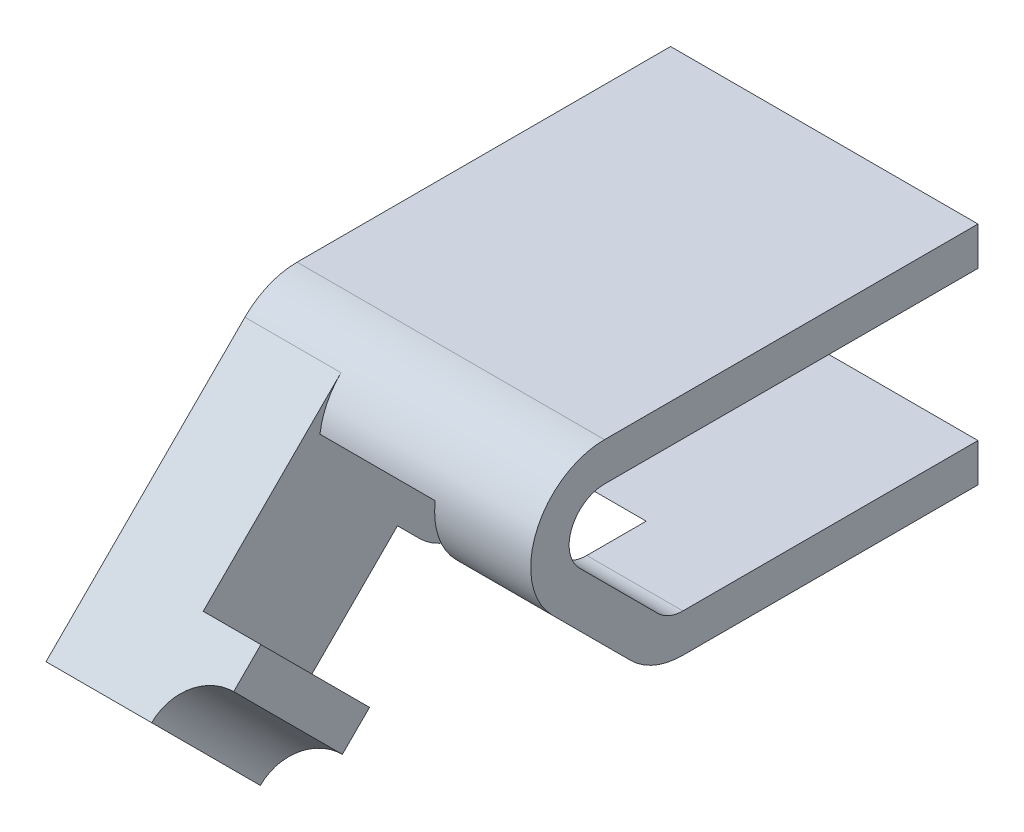
ISO-10303-21;
HEADER;
FILE_DESCRIPTION(('STEP AP214'),'2;1');
FILE_NAME('part.step','',(''),(''),'','','');
FILE_SCHEMA(('AUTOMOTIVE_DESIGN { 1 0 10303 214 1 1 1 1 }'));
ENDSEC;
DATA;
#1=APPLICATION_CONTEXT('core data for automotive mechanical design processes');
#2=APPLICATION_PROTOCOL_DEFINITION('international standard','automotive_design',2000,#1);
#3=PRODUCT_CONTEXT('',#1,'mechanical');
#4=PRODUCT('Part','Part','',(#3));
#5=PRODUCT_RELATED_PRODUCT_CATEGORY('part','',(#4));
#6=PRODUCT_DEFINITION_FORMATION('','',#4);
#7=PRODUCT_DEFINITION_CONTEXT('part definition',#1,'design');
#8=PRODUCT_DEFINITION('design','',#6,#7);
#9=PRODUCT_DEFINITION_SHAPE('','',#8);
#10=(LENGTH_UNIT() NAMED_UNIT(*) SI_UNIT(.MILLI.,.METRE.));
#11=(NAMED_UNIT(*) PLANE_ANGLE_UNIT() SI_UNIT($,.RADIAN.));
#12=(NAMED_UNIT(*) SI_UNIT($,.STERADIAN.) SOLID_ANGLE_UNIT());
#13=UNCERTAINTY_MEASURE_WITH_UNIT(LENGTH_MEASURE(1.E-05),#10,'distance_accuracy_value','');
#14=(GEOMETRIC_REPRESENTATION_CONTEXT(3) GLOBAL_UNCERTAINTY_ASSIGNED_CONTEXT((#13)) GLOBAL_UNIT_ASSIGNED_CONTEXT((#10,
#11,#12)) REPRESENTATION_CONTEXT('',''));
#15=CARTESIAN_POINT('',(0.,0.,0.));
#16=DIRECTION('',(0.,0.,1.));
#17=DIRECTION('',(1.,0.,0.));
#18=AXIS2_PLACEMENT_3D('',#15,#16,#17);
#19=CARTESIAN_POINT('',(25.4,-5.588,0.));
#20=DIRECTION('',(-1.,0.,0.));
#21=DIRECTION('',(0.,0.,1.));
#22=AXIS2_PLACEMENT_3D('',#19,#20,#21);
#23=CYLINDRICAL_SURFACE('',#22,12.192);
#24=DIRECTION('',(-1.,0.,0.));
#25=VECTOR('',#24,1.);
#26=CARTESIAN_POINT('',(9.75224461638645,3.0330458762264,8.62104587622637));
#27=LINE('',#26,#25);
#28=CARTESIAN_POINT('',(-9.525,3.0330458762264,8.62104587622637));
#29=VERTEX_POINT('',#28);
#30=CARTESIAN_POINT('',(-25.4,3.0330458762264,8.62104587622637));
#31=VERTEX_POINT('',#30);
#32=EDGE_CURVE('E241',#29,#31,#27,.T.);
#33=ORIENTED_EDGE('',*,*,#32,.F.);
#34=CARTESIAN_POINT('',(-9.525,-5.588,0.));
#35=DIRECTION('',(-1.,0.,0.));
#36=DIRECTION('',(0.,0.,1.));
#37=AXIS2_PLACEMENT_3D('',#34,#35,#36);
#38=CIRCLE('',#37,12.192);
#39=CARTESIAN_POINT('',(-9.525,-4.03006145173267,12.0920507557578));
#40=VERTEX_POINT('',#39);
#41=EDGE_CURVE('E249',#40,#29,#38,.T.);
#42=ORIENTED_EDGE('',*,*,#41,.F.);
#43=DIRECTION('',(-1.,0.,0.));
#44=VECTOR('',#43,1.);
#45=CARTESIAN_POINT('',(25.4,-4.03006145173266,12.0920507557578));
#46=LINE('',#45,#44);
#47=CARTESIAN_POINT('',(9.525,-4.03006145173267,12.0920507557578));
#48=VERTEX_POINT('',#47);
#49=EDGE_CURVE('E44',#40,#48,#46,.F.);
#50=ORIENTED_EDGE('',*,*,#49,.T.);
#51=CARTESIAN_POINT('',(9.525,-5.588,0.));
#52=DIRECTION('',(-1.,0.,0.));
#53=DIRECTION('',(0.,0.,1.));
#54=AXIS2_PLACEMENT_3D('',#51,#52,#53);
#55=CIRCLE('',#54,12.192);
#56=CARTESIAN_POINT('',(9.525,-14.2090458762264,8.62104587622641));
#57=VERTEX_POINT('',#56);
#58=EDGE_CURVE('E309',#57,#48,#55,.T.);
#59=ORIENTED_EDGE('',*,*,#58,.F.);
#60=DIRECTION('',(-1.,0.,0.));
#61=VECTOR('',#60,1.);
#62=CARTESIAN_POINT('',(25.4,-14.2090458762264,8.6210458762264));
#63=LINE('',#62,#61);
#64=CARTESIAN_POINT('',(25.4,-14.2090458762264,8.6210458762264));
#65=VERTEX_POINT('',#64);
#66=EDGE_CURVE('E275',#65,#57,#63,.T.);
#67=ORIENTED_EDGE('',*,*,#66,.F.);
#68=CARTESIAN_POINT('',(25.4,-5.588,0.));
#69=DIRECTION('',(1.,0.,0.));
#70=DIRECTION('',(0.,0.,-1.));
#71=AXIS2_PLACEMENT_3D('',#68,#69,#70);
#72=CIRCLE('',#71,12.192);
#73=CARTESIAN_POINT('',(25.4,6.604,0.));
#74=VERTEX_POINT('',#73);
#75=EDGE_CURVE('E381',#74,#65,#72,.T.);
#76=ORIENTED_EDGE('',*,*,#75,.F.);
#77=DIRECTION('',(-1.,0.,0.));
#78=VECTOR('',#77,1.);
#79=CARTESIAN_POINT('',(25.4,6.604,0.));
#80=LINE('',#79,#78);
#81=CARTESIAN_POINT('',(-25.4,6.604,0.));
#82=VERTEX_POINT('',#81);
#83=EDGE_CURVE('E254',#74,#82,#80,.T.);
#84=ORIENTED_EDGE('',*,*,#83,.T.);
#85=CARTESIAN_POINT('',(-25.4,-5.588,0.));
#86=DIRECTION('',(1.,0.,0.));
#87=DIRECTION('',(0.,0.,-1.));
#88=AXIS2_PLACEMENT_3D('',#85,#86,#87);
#89=CIRCLE('',#88,12.192);
#90=EDGE_CURVE('E231',#82,#31,#89,.T.);
#91=ORIENTED_EDGE('',*,*,#90,.T.);
#92=EDGE_LOOP('',(#33,#42,#50,#59,#67,#76,#84,#91));
#93=FACE_BOUND('',#92,.T.);
#94=ADVANCED_FACE('F36',(#93),#23,.T.);
#95=CARTESIAN_POINT('',(25.4,-14.2090458762264,8.6210458762264));
#96=DIRECTION('',(0.,0.707106781186546,-0.707106781186549));
#97=DIRECTION('',(0.,0.707106781186549,0.707106781186546));
#98=AXIS2_PLACEMENT_3D('',#95,#96,#97);
#99=PLANE('',#98);
#100=DIRECTION('',(-1.,0.,0.));
#101=VECTOR('',#100,1.);
#102=CARTESIAN_POINT('',(-25.4,-23.5485122421383,-0.718420489685498));
#103=LINE('',#102,#101);
#104=CARTESIAN_POINT('',(-9.525,-23.5485122421383,-0.718420489685511));
#105=VERTEX_POINT('',#104);
#106=CARTESIAN_POINT('',(-25.4,-23.5485122421383,-0.718420489685498));
#107=VERTEX_POINT('',#106);
#108=EDGE_CURVE('E459',#105,#107,#103,.T.);
#109=ORIENTED_EDGE('',*,*,#108,.T.);
#110=DIRECTION('',(0.,-0.707106781186549,-0.707106781186546));
#111=VECTOR('',#110,1.);
#112=CARTESIAN_POINT('',(-25.4,-14.2090458762264,8.6210458762264));
#113=LINE('',#112,#111);
#114=CARTESIAN_POINT('',(-25.4,-27.1630458762264,-4.33295412377356));
#115=VERTEX_POINT('',#114);
#116=EDGE_CURVE('E255',#107,#115,#113,.T.);
#117=ORIENTED_EDGE('',*,*,#116,.T.);
#118=DIRECTION('',(-1.,0.,0.));
#119=VECTOR('',#118,1.);
#120=CARTESIAN_POINT('',(25.4,-27.1630458762264,-4.33295412377356));
#121=LINE('',#120,#119);
#122=CARTESIAN_POINT('',(-9.525,-27.1630458762264,-4.33295412377358));
#123=VERTEX_POINT('',#122);
#124=EDGE_CURVE('E270',#123,#115,#121,.T.);
#125=ORIENTED_EDGE('',*,*,#124,.F.);
#126=DIRECTION('',(0.,-0.707106781186547,-0.707106781186548));
#127=VECTOR('',#126,1.);
#128=CARTESIAN_POINT('',(-9.525,-30.734,-7.90390824754722));
#129=LINE('',#128,#127);
#130=EDGE_CURVE('E332',#105,#123,#129,.T.);
#131=ORIENTED_EDGE('',*,*,#130,.F.);
#132=EDGE_LOOP('',(#109,#117,#125,#131));
#133=FACE_BOUND('',#132,.T.);
#134=ADVANCED_FACE('F457',(#133),#99,.F.);
#135=CARTESIAN_POINT('',(25.4,-18.542,-12.9539999999999));
#136=DIRECTION('',(-1.,0.,0.));
#137=DIRECTION('',(0.,0.,1.));
#138=AXIS2_PLACEMENT_3D('',#135,#136,#137);
#139=CYLINDRICAL_SURFACE('',#138,5.842);
#140=DIRECTION('',(-1.,0.,0.));
#141=VECTOR('',#140,1.);
#142=CARTESIAN_POINT('',(25.4,-24.384,-12.9539999999999));
#143=LINE('',#142,#141);
#144=CARTESIAN_POINT('',(25.4,-24.384,-12.9539999999999));
#145=VERTEX_POINT('',#144);
#146=CARTESIAN_POINT('',(9.525,-24.384,-12.9539999999999));
#147=VERTEX_POINT('',#146);
#148=EDGE_CURVE('E294',#145,#147,#143,.T.);
#149=ORIENTED_EDGE('',*,*,#148,.T.);
#150=CARTESIAN_POINT('',(9.525,-18.542,-12.9539999999999));
#151=DIRECTION('',(-1.,0.,0.));
#152=DIRECTION('',(0.,0.,1.));
#153=AXIS2_PLACEMENT_3D('',#150,#151,#152);
#154=CIRCLE('',#153,5.842);
#155=CARTESIAN_POINT('',(9.525,-22.6729178156918,-8.82308218430814));
#156=VERTEX_POINT('',#155);
#157=EDGE_CURVE('E340',#147,#156,#154,.T.);
#158=ORIENTED_EDGE('',*,*,#157,.T.);
#159=DIRECTION('',(-1.,0.,0.));
#160=VECTOR('',#159,1.);
#161=CARTESIAN_POINT('',(25.4,-22.6729178156918,-8.82308218430814));
#162=LINE('',#161,#160);
#163=CARTESIAN_POINT('',(25.4,-22.6729178156918,-8.82308218430814));
#164=VERTEX_POINT('',#163);
#165=EDGE_CURVE('E290',#164,#156,#162,.T.);
#166=ORIENTED_EDGE('',*,*,#165,.F.);
#167=CARTESIAN_POINT('',(25.4,-18.542,-12.9539999999999));
#168=DIRECTION('',(1.,0.,0.));
#169=DIRECTION('',(0.,0.,-1.));
#170=AXIS2_PLACEMENT_3D('',#167,#168,#169);
#171=CIRCLE('',#170,5.842);
#172=EDGE_CURVE('E364',#164,#145,#171,.T.);
#173=ORIENTED_EDGE('',*,*,#172,.T.);
#174=EDGE_LOOP('',(#149,#158,#166,#173));
#175=FACE_BOUND('',#174,.T.);
#176=ADVANCED_FACE('F508',(#175),#139,.F.);
#177=CARTESIAN_POINT('',(25.4,-9.7189178156918,4.13091781569182));
#178=DIRECTION('',(0.,0.707106781186546,-0.707106781186549));
#179=DIRECTION('',(0.,0.707106781186549,0.707106781186546));
#180=AXIS2_PLACEMENT_3D('',#177,#178,#179);
#181=PLANE('',#180);
#182=ORIENTED_EDGE('',*,*,#165,.T.);
#183=DIRECTION('',(0.,0.707106781186549,0.707106781186546));
#184=VECTOR('',#183,1.);
#185=CARTESIAN_POINT('',(9.525,-9.7189178156918,4.13091781569182));
#186=LINE('',#185,#184);
#187=CARTESIAN_POINT('',(9.525,-9.7189178156918,4.13091781569182));
#188=VERTEX_POINT('',#187);
#189=EDGE_CURVE('E337',#156,#188,#186,.T.);
#190=ORIENTED_EDGE('',*,*,#189,.T.);
#191=DIRECTION('',(-1.,0.,0.));
#192=VECTOR('',#191,1.);
#193=CARTESIAN_POINT('',(25.4,-9.7189178156918,4.13091781569182));
#194=LINE('',#193,#192);
#195=CARTESIAN_POINT('',(25.4,-9.7189178156918,4.13091781569182));
#196=VERTEX_POINT('',#195);
#197=EDGE_CURVE('E286',#196,#188,#194,.T.);
#198=ORIENTED_EDGE('',*,*,#197,.F.);
#199=DIRECTION('',(0.,-0.707106781186549,-0.707106781186546));
#200=VECTOR('',#199,1.);
#201=CARTESIAN_POINT('',(25.4,-9.7189178156918,4.13091781569182));
#202=LINE('',#201,#200);
#203=EDGE_CURVE('E367',#196,#164,#202,.T.);
#204=ORIENTED_EDGE('',*,*,#203,.T.);
#205=EDGE_LOOP('',(#182,#190,#198,#204));
#206=FACE_BOUND('',#205,.T.);
#207=ADVANCED_FACE('F504',(#206),#181,.T.);
#208=DIRECTION('',(0.,-0.707106781186547,-0.707106781186548));
#209=VECTOR('',#208,1.);
#210=CARTESIAN_POINT('',(9.525,-30.734,-7.90390824754722));
#211=LINE('',#210,#209);
#212=CARTESIAN_POINT('',(9.525,-27.1630458762264,-4.33295412377358));
#213=VERTEX_POINT('',#212);
#214=EDGE_CURVE('E319',#57,#213,#211,.T.);
#215=ORIENTED_EDGE('',*,*,#214,.T.);
#216=CARTESIAN_POINT('',(25.4,-27.1630458762264,-4.33295412377356));
#217=VERTEX_POINT('',#216);
#218=EDGE_CURVE('E272',#217,#213,#121,.T.);
#219=ORIENTED_EDGE('',*,*,#218,.F.);
#220=DIRECTION('',(0.,-0.707106781186549,-0.707106781186546));
#221=VECTOR('',#220,1.);
#222=CARTESIAN_POINT('',(25.4,-14.2090458762264,8.6210458762264));
#223=LINE('',#222,#221);
#224=EDGE_CURVE('E383',#65,#217,#223,.T.);
#225=ORIENTED_EDGE('',*,*,#224,.F.);
#226=ORIENTED_EDGE('',*,*,#66,.T.);
#227=EDGE_LOOP('',(#215,#219,#225,#226));
#228=FACE_BOUND('',#227,.T.);
#229=ADVANCED_FACE('F554',(#228),#99,.F.);
#230=CARTESIAN_POINT('',(25.4,-18.542,-12.9539999999999));
#231=DIRECTION('',(-1.,0.,0.));
#232=DIRECTION('',(0.,0.,1.));
#233=AXIS2_PLACEMENT_3D('',#230,#231,#232);
#234=CYLINDRICAL_SURFACE('',#233,12.192);
#235=CARTESIAN_POINT('',(9.525,-18.542,-12.9539999999999));
#236=DIRECTION('',(-1.,0.,0.));
#237=DIRECTION('',(0.,0.,1.));
#238=AXIS2_PLACEMENT_3D('',#235,#236,#237);
#239=CIRCLE('',#238,12.192);
#240=CARTESIAN_POINT('',(9.525,-30.734,-12.9539999999999));
#241=VERTEX_POINT('',#240);
#242=EDGE_CURVE('E301',#241,#213,#239,.T.);
#243=ORIENTED_EDGE('',*,*,#242,.F.);
#244=DIRECTION('',(-1.,0.,0.));
#245=VECTOR('',#244,1.);
#246=CARTESIAN_POINT('',(25.4,-30.734,-12.9539999999999));
#247=LINE('',#246,#245);
#248=CARTESIAN_POINT('',(25.4,-30.734,-12.9539999999999));
#249=VERTEX_POINT('',#248);
#250=EDGE_CURVE('E267',#249,#241,#247,.T.);
#251=ORIENTED_EDGE('',*,*,#250,.F.);
#252=CARTESIAN_POINT('',(25.4,-18.542,-12.9539999999999));
#253=DIRECTION('',(1.,0.,0.));
#254=DIRECTION('',(0.,0.,-1.));
#255=AXIS2_PLACEMENT_3D('',#252,#253,#254);
#256=CIRCLE('',#255,12.192);
#257=EDGE_CURVE('E385',#217,#249,#256,.T.);
#258=ORIENTED_EDGE('',*,*,#257,.F.);
#259=ORIENTED_EDGE('',*,*,#218,.T.);
#260=EDGE_LOOP('',(#243,#251,#258,#259));
#261=FACE_BOUND('',#260,.T.);
#262=ADVANCED_FACE('F576',(#261),#234,.T.);
#263=CARTESIAN_POINT('',(25.4,-30.734,-12.9539999999999));
#264=DIRECTION('',(0.,1.,0.));
#265=DIRECTION('',(0.,0.,1.));
#266=AXIS2_PLACEMENT_3D('',#263,#264,#265);
#267=PLANE('',#266);
#268=DIRECTION('',(1.,0.,0.));
#269=VECTOR('',#268,1.);
#270=CARTESIAN_POINT('',(-9.525,-30.734,-29.1171116831437));
#271=LINE('',#270,#269);
#272=CARTESIAN_POINT('',(-9.525,-30.734,-29.1171116831437));
#273=VERTEX_POINT('',#272);
#274=CARTESIAN_POINT('',(9.525,-30.734,-29.1171116831437));
#275=VERTEX_POINT('',#274);
#276=EDGE_CURVE('E330',#273,#275,#271,.T.);
#277=ORIENTED_EDGE('',*,*,#276,.F.);
#278=DIRECTION('',(0.,0.,-1.));
#279=VECTOR('',#278,1.);
#280=CARTESIAN_POINT('',(-9.525,-30.734,-29.1171116831437));
#281=LINE('',#280,#279);
#282=CARTESIAN_POINT('',(-9.525,-30.734,-12.9539999999999));
#283=VERTEX_POINT('',#282);
#284=EDGE_CURVE('E323',#283,#273,#281,.T.);
#285=ORIENTED_EDGE('',*,*,#284,.F.);
#286=CARTESIAN_POINT('',(-25.4,-30.734,-12.9539999999999));
#287=VERTEX_POINT('',#286);
#288=EDGE_CURVE('E271',#283,#287,#247,.T.);
#289=ORIENTED_EDGE('',*,*,#288,.T.);
#290=DIRECTION('',(0.,0.,-1.));
#291=VECTOR('',#290,1.);
#292=CARTESIAN_POINT('',(-25.4,-30.734,-12.9539999999999));
#293=LINE('',#292,#291);
#294=CARTESIAN_POINT('',(-25.4,-30.734,-61.722));
#295=VERTEX_POINT('',#294);
#296=EDGE_CURVE('E356',#287,#295,#293,.T.);
#297=ORIENTED_EDGE('',*,*,#296,.T.);
#298=DIRECTION('',(-1.,0.,0.));
#299=VECTOR('',#298,1.);
#300=CARTESIAN_POINT('',(25.4,-30.734,-61.722));
#301=LINE('',#300,#299);
#302=CARTESIAN_POINT('',(25.4,-30.734,-61.722));
#303=VERTEX_POINT('',#302);
#304=EDGE_CURVE('E299',#303,#295,#301,.T.);
#305=ORIENTED_EDGE('',*,*,#304,.F.);
#306=DIRECTION('',(0.,0.,-1.));
#307=VECTOR('',#306,1.);
#308=CARTESIAN_POINT('',(25.4,-30.734,-12.9539999999999));
#309=LINE('',#308,#307);
#310=EDGE_CURVE('E266',#249,#303,#309,.T.);
#311=ORIENTED_EDGE('',*,*,#310,.F.);
#312=ORIENTED_EDGE('',*,*,#250,.T.);
#313=DIRECTION('',(0.,0.,-1.));
#314=VECTOR('',#313,1.);
#315=CARTESIAN_POINT('',(9.525,-30.734,-29.1171116831437));
#316=LINE('',#315,#314);
#317=EDGE_CURVE('E483',#241,#275,#316,.T.);
#318=ORIENTED_EDGE('',*,*,#317,.T.);
#319=EDGE_LOOP('',(#277,#285,#289,#297,#305,#311,#312,#318));
#320=FACE_BOUND('',#319,.T.);
#321=ADVANCED_FACE('F38',(#320),#267,.F.);
#322=CARTESIAN_POINT('',(25.4,-24.384,-61.722));
#323=DIRECTION('',(0.,0.,-1.));
#324=DIRECTION('',(-1.,0.,0.));
#325=AXIS2_PLACEMENT_3D('',#322,#323,#324);
#326=PLANE('',#325);
#327=DIRECTION('',(0.,-1.,0.));
#328=VECTOR('',#327,1.);
#329=CARTESIAN_POINT('',(-25.4,-24.384,-61.722));
#330=LINE('',#329,#328);
#331=CARTESIAN_POINT('',(-25.4,-24.384,-61.722));
#332=VERTEX_POINT('',#331);
#333=EDGE_CURVE('E389',#332,#295,#330,.T.);
#334=ORIENTED_EDGE('',*,*,#333,.F.);
#335=DIRECTION('',(-1.,0.,0.));
#336=VECTOR('',#335,1.);
#337=CARTESIAN_POINT('',(25.4,-24.384,-61.722));
#338=LINE('',#337,#336);
#339=CARTESIAN_POINT('',(25.4,-24.384,-61.722));
#340=VERTEX_POINT('',#339);
#341=EDGE_CURVE('E297',#340,#332,#338,.T.);
#342=ORIENTED_EDGE('',*,*,#341,.F.);
#343=DIRECTION('',(0.,-1.,0.));
#344=VECTOR('',#343,1.);
#345=CARTESIAN_POINT('',(25.4,-24.384,-61.722));
#346=LINE('',#345,#344);
#347=EDGE_CURVE('E358',#340,#303,#346,.T.);
#348=ORIENTED_EDGE('',*,*,#347,.T.);
#349=ORIENTED_EDGE('',*,*,#304,.T.);
#350=EDGE_LOOP('',(#334,#342,#348,#349));
#351=FACE_BOUND('',#350,.T.);
#352=ADVANCED_FACE('F440',(#351),#326,.T.);
#353=CARTESIAN_POINT('',(25.4,-24.384,-12.9539999999999));
#354=DIRECTION('',(0.,1.,0.));
#355=DIRECTION('',(0.,0.,1.));
#356=AXIS2_PLACEMENT_3D('',#353,#354,#355);
#357=PLANE('',#356);
#358=DIRECTION('',(0.,0.,1.));
#359=VECTOR('',#358,1.);
#360=CARTESIAN_POINT('',(-9.525,-24.384,-12.9539999999999));
#361=LINE('',#360,#359);
#362=CARTESIAN_POINT('',(-9.525,-24.384,-22.7671116831437));
#363=VERTEX_POINT('',#362);
#364=CARTESIAN_POINT('',(-9.525,-24.384,-12.9539999999999));
#365=VERTEX_POINT('',#364);
#366=EDGE_CURVE('E352',#363,#365,#361,.T.);
#367=ORIENTED_EDGE('',*,*,#366,.F.);
#368=DIRECTION('',(-1.,0.,0.));
#369=VECTOR('',#368,1.);
#370=CARTESIAN_POINT('',(25.4,-24.384,-22.7671116831437));
#371=LINE('',#370,#369);
#372=CARTESIAN_POINT('',(9.525,-24.384,-22.7671116831437));
#373=VERTEX_POINT('',#372);
#374=EDGE_CURVE('E354',#373,#363,#371,.T.);
#375=ORIENTED_EDGE('',*,*,#374,.F.);
#376=DIRECTION('',(0.,0.,1.));
#377=VECTOR('',#376,1.);
#378=CARTESIAN_POINT('',(9.525,-24.384,-12.9539999999999));
#379=LINE('',#378,#377);
#380=EDGE_CURVE('E343',#373,#147,#379,.T.);
#381=ORIENTED_EDGE('',*,*,#380,.T.);
#382=ORIENTED_EDGE('',*,*,#148,.F.);
#383=DIRECTION('',(0.,0.,-1.));
#384=VECTOR('',#383,1.);
#385=CARTESIAN_POINT('',(25.4,-24.384,-12.9539999999999));
#386=LINE('',#385,#384);
#387=EDGE_CURVE('E361',#145,#340,#386,.T.);
#388=ORIENTED_EDGE('',*,*,#387,.T.);
#389=ORIENTED_EDGE('',*,*,#341,.T.);
#390=DIRECTION('',(0.,0.,-1.));
#391=VECTOR('',#390,1.);
#392=CARTESIAN_POINT('',(-25.4,-24.384,-12.9539999999999));
#393=LINE('',#392,#391);
#394=CARTESIAN_POINT('',(-25.4,-24.384,-12.9539999999999));
#395=VERTEX_POINT('',#394);
#396=EDGE_CURVE('E392',#395,#332,#393,.T.);
#397=ORIENTED_EDGE('',*,*,#396,.F.);
#398=EDGE_CURVE('E293',#365,#395,#143,.T.);
#399=ORIENTED_EDGE('',*,*,#398,.F.);
#400=EDGE_LOOP('',(#367,#375,#381,#382,#388,#389,#397,#399));
#401=FACE_BOUND('',#400,.T.);
#402=ADVANCED_FACE('F435',(#401),#357,.T.);
#403=CARTESIAN_POINT('',(-9.525,-18.542,-12.9539999999999));
#404=DIRECTION('',(-1.,0.,0.));
#405=DIRECTION('',(0.,0.,1.));
#406=AXIS2_PLACEMENT_3D('',#403,#404,#405);
#407=CIRCLE('',#406,5.842);
#408=CARTESIAN_POINT('',(-9.525,-22.6729178156918,-8.82308218430814));
#409=VERTEX_POINT('',#408);
#410=EDGE_CURVE('E350',#365,#409,#407,.T.);
#411=ORIENTED_EDGE('',*,*,#410,.F.);
#412=ORIENTED_EDGE('',*,*,#398,.T.);
#413=CARTESIAN_POINT('',(-25.4,-18.542,-12.9539999999999));
#414=DIRECTION('',(1.,0.,0.));
#415=DIRECTION('',(0.,0.,-1.));
#416=AXIS2_PLACEMENT_3D('',#413,#414,#415);
#417=CIRCLE('',#416,5.842);
#418=CARTESIAN_POINT('',(-25.4,-22.6729178156918,-8.82308218430814));
#419=VERTEX_POINT('',#418);
#420=EDGE_CURVE('E395',#419,#395,#417,.T.);
#421=ORIENTED_EDGE('',*,*,#420,.F.);
#422=EDGE_CURVE('E289',#409,#419,#162,.T.);
#423=ORIENTED_EDGE('',*,*,#422,.F.);
#424=EDGE_LOOP('',(#411,#412,#421,#423));
#425=FACE_BOUND('',#424,.T.);
#426=ADVANCED_FACE('F430',(#425),#139,.F.);
#427=DIRECTION('',(0.,0.707106781186549,0.707106781186546));
#428=VECTOR('',#427,1.);
#429=CARTESIAN_POINT('',(-9.525,-9.7189178156918,4.13091781569182));
#430=LINE('',#429,#428);
#431=CARTESIAN_POINT('',(-9.525,-9.7189178156918,4.13091781569182));
#432=VERTEX_POINT('',#431);
#433=EDGE_CURVE('E348',#409,#432,#430,.T.);
#434=ORIENTED_EDGE('',*,*,#433,.F.);
#435=ORIENTED_EDGE('',*,*,#422,.T.);
#436=DIRECTION('',(0.,-0.707106781186549,-0.707106781186546));
#437=VECTOR('',#436,1.);
#438=CARTESIAN_POINT('',(-25.4,-9.7189178156918,4.13091781569182));
#439=LINE('',#438,#437);
#440=CARTESIAN_POINT('',(-25.4,-9.7189178156918,4.13091781569182));
#441=VERTEX_POINT('',#440);
#442=EDGE_CURVE('E398',#441,#419,#439,.T.);
#443=ORIENTED_EDGE('',*,*,#442,.F.);
#444=EDGE_CURVE('E285',#432,#441,#194,.T.);
#445=ORIENTED_EDGE('',*,*,#444,.F.);
#446=EDGE_LOOP('',(#434,#435,#443,#445));
#447=FACE_BOUND('',#446,.T.);
#448=ADVANCED_FACE('F426',(#447),#181,.T.);
#449=CARTESIAN_POINT('',(25.4,-5.588,0.));
#450=DIRECTION('',(-1.,0.,0.));
#451=DIRECTION('',(0.,0.,1.));
#452=AXIS2_PLACEMENT_3D('',#449,#450,#451);
#453=CYLINDRICAL_SURFACE('',#452,5.842);
#454=CARTESIAN_POINT('',(-9.525,-5.588,0.));
#455=DIRECTION('',(-1.,0.,0.));
#456=DIRECTION('',(0.,0.,1.));
#457=AXIS2_PLACEMENT_3D('',#454,#455,#456);
#458=CIRCLE('',#457,5.842);
#459=CARTESIAN_POINT('',(-9.525,0.0199928665592835,1.63688118341564));
#460=VERTEX_POINT('',#459);
#461=EDGE_CURVE('E346',#432,#460,#458,.T.);
#462=ORIENTED_EDGE('',*,*,#461,.F.);
#463=ORIENTED_EDGE('',*,*,#444,.T.);
#464=CARTESIAN_POINT('',(-25.4,-5.588,0.));
#465=DIRECTION('',(1.,0.,0.));
#466=DIRECTION('',(0.,0.,-1.));
#467=AXIS2_PLACEMENT_3D('',#464,#465,#466);
#468=CIRCLE('',#467,5.842);
#469=CARTESIAN_POINT('',(-25.4,0.254,0.));
#470=VERTEX_POINT('',#469);
#471=EDGE_CURVE('E401',#470,#441,#468,.T.);
#472=ORIENTED_EDGE('',*,*,#471,.F.);
#473=DIRECTION('',(-1.,0.,0.));
#474=VECTOR('',#473,1.);
#475=CARTESIAN_POINT('',(25.4,0.254,0.));
#476=LINE('',#475,#474);
#477=CARTESIAN_POINT('',(25.4,0.254,0.));
#478=VERTEX_POINT('',#477);
#479=EDGE_CURVE('E283',#478,#470,#476,.T.);
#480=ORIENTED_EDGE('',*,*,#479,.F.);
#481=CARTESIAN_POINT('',(25.4,-5.588,0.));
#482=DIRECTION('',(1.,0.,0.));
#483=DIRECTION('',(0.,0.,-1.));
#484=AXIS2_PLACEMENT_3D('',#481,#482,#483);
#485=CIRCLE('',#484,5.842);
#486=EDGE_CURVE('E370',#478,#196,#485,.T.);
#487=ORIENTED_EDGE('',*,*,#486,.T.);
#488=ORIENTED_EDGE('',*,*,#197,.T.);
#489=CARTESIAN_POINT('',(9.525,-5.588,0.));
#490=DIRECTION('',(-1.,0.,0.));
#491=DIRECTION('',(0.,0.,1.));
#492=AXIS2_PLACEMENT_3D('',#489,#490,#491);
#493=CIRCLE('',#492,5.842);
#494=CARTESIAN_POINT('',(9.525,0.0199928665592835,1.63688118341564));
#495=VERTEX_POINT('',#494);
#496=EDGE_CURVE('E334',#188,#495,#493,.T.);
#497=ORIENTED_EDGE('',*,*,#496,.T.);
#498=DIRECTION('',(-1.,0.,0.));
#499=VECTOR('',#498,1.);
#500=CARTESIAN_POINT('',(25.4,0.0199928665592826,1.63688118341564));
#501=LINE('',#500,#499);
#502=EDGE_CURVE('E12',#460,#495,#501,.F.);
#503=ORIENTED_EDGE('',*,*,#502,.F.);
#504=EDGE_LOOP('',(#462,#463,#472,#480,#487,#488,#497,#503));
#505=FACE_BOUND('',#504,.T.);
#506=ADVANCED_FACE('F420',(#505),#453,.F.);
#507=CARTESIAN_POINT('',(25.4,0.254,0.));
#508=DIRECTION('',(0.,-1.,0.));
#509=DIRECTION('',(0.,0.,-1.));
#510=AXIS2_PLACEMENT_3D('',#507,#508,#509);
#511=PLANE('',#510);
#512=DIRECTION('',(0.,0.,1.));
#513=VECTOR('',#512,1.);
#514=CARTESIAN_POINT('',(-25.4,0.254,0.));
#515=LINE('',#514,#513);
#516=CARTESIAN_POINT('',(-25.4,0.254,-61.722));
#517=VERTEX_POINT('',#516);
#518=EDGE_CURVE('E404',#517,#470,#515,.T.);
#519=ORIENTED_EDGE('',*,*,#518,.F.);
#520=DIRECTION('',(-1.,0.,0.));
#521=VECTOR('',#520,1.);
#522=CARTESIAN_POINT('',(25.4,0.254,-61.722));
#523=LINE('',#522,#521);
#524=CARTESIAN_POINT('',(25.4,0.254,-61.722));
#525=VERTEX_POINT('',#524);
#526=EDGE_CURVE('E281',#525,#517,#523,.T.);
#527=ORIENTED_EDGE('',*,*,#526,.F.);
#528=DIRECTION('',(0.,0.,1.));
#529=VECTOR('',#528,1.);
#530=CARTESIAN_POINT('',(25.4,0.254,0.));
#531=LINE('',#530,#529);
#532=EDGE_CURVE('E373',#525,#478,#531,.T.);
#533=ORIENTED_EDGE('',*,*,#532,.T.);
#534=ORIENTED_EDGE('',*,*,#479,.T.);
#535=EDGE_LOOP('',(#519,#527,#533,#534));
#536=FACE_BOUND('',#535,.T.);
#537=ADVANCED_FACE('F415',(#536),#511,.T.);
#538=CARTESIAN_POINT('',(25.4,6.604,-61.722));
#539=DIRECTION('',(0.,0.,-1.));
#540=DIRECTION('',(-1.,0.,0.));
#541=AXIS2_PLACEMENT_3D('',#538,#539,#540);
#542=PLANE('',#541);
#543=DIRECTION('',(0.,-1.,0.));
#544=VECTOR('',#543,1.);
#545=CARTESIAN_POINT('',(-25.4,6.604,-61.722));
#546=LINE('',#545,#544);
#547=CARTESIAN_POINT('',(-25.4,6.604,-61.722));
#548=VERTEX_POINT('',#547);
#549=EDGE_CURVE('E260',#548,#517,#546,.T.);
#550=ORIENTED_EDGE('',*,*,#549,.F.);
#551=DIRECTION('',(-1.,0.,0.));
#552=VECTOR('',#551,1.);
#553=CARTESIAN_POINT('',(25.4,6.604,-61.722));
#554=LINE('',#553,#552);
#555=CARTESIAN_POINT('',(25.4,6.604,-61.722));
#556=VERTEX_POINT('',#555);
#557=EDGE_CURVE('E279',#556,#548,#554,.T.);
#558=ORIENTED_EDGE('',*,*,#557,.F.);
#559=DIRECTION('',(0.,-1.,0.));
#560=VECTOR('',#559,1.);
#561=CARTESIAN_POINT('',(25.4,6.604,-61.722));
#562=LINE('',#561,#560);
#563=EDGE_CURVE('E376',#556,#525,#562,.T.);
#564=ORIENTED_EDGE('',*,*,#563,.T.);
#565=ORIENTED_EDGE('',*,*,#526,.T.);
#566=EDGE_LOOP('',(#550,#558,#564,#565));
#567=FACE_BOUND('',#566,.T.);
#568=ADVANCED_FACE('F410',(#567),#542,.T.);
#569=CARTESIAN_POINT('',(25.4,6.604,0.));
#570=DIRECTION('',(0.,-1.,0.));
#571=DIRECTION('',(0.,0.,-1.));
#572=AXIS2_PLACEMENT_3D('',#569,#570,#571);
#573=PLANE('',#572);
#574=DIRECTION('',(0.,0.,-1.));
#575=VECTOR('',#574,1.);
#576=CARTESIAN_POINT('',(-25.4,6.604,0.));
#577=LINE('',#576,#575);
#578=EDGE_CURVE('E256',#548,#82,#577,.F.);
#579=ORIENTED_EDGE('',*,*,#578,.T.);
#580=ORIENTED_EDGE('',*,*,#83,.F.);
#581=DIRECTION('',(0.,0.,-1.));
#582=VECTOR('',#581,1.);
#583=CARTESIAN_POINT('',(25.4,6.604,0.));
#584=LINE('',#583,#582);
#585=EDGE_CURVE('E379',#556,#74,#584,.F.);
#586=ORIENTED_EDGE('',*,*,#585,.F.);
#587=ORIENTED_EDGE('',*,*,#557,.T.);
#588=EDGE_LOOP('',(#579,#580,#586,#587));
#589=FACE_BOUND('',#588,.T.);
#590=ADVANCED_FACE('F557',(#589),#573,.F.);
#591=ORIENTED_EDGE('',*,*,#288,.F.);
#592=CARTESIAN_POINT('',(-9.525,-18.542,-12.9539999999999));
#593=DIRECTION('',(-1.,0.,0.));
#594=DIRECTION('',(0.,0.,1.));
#595=AXIS2_PLACEMENT_3D('',#592,#593,#594);
#596=CIRCLE('',#595,12.192);
#597=EDGE_CURVE('E303',#283,#123,#596,.T.);
#598=ORIENTED_EDGE('',*,*,#597,.T.);
#599=ORIENTED_EDGE('',*,*,#124,.T.);
#600=CARTESIAN_POINT('',(-25.4,-18.542,-12.9539999999999));
#601=DIRECTION('',(1.,0.,0.));
#602=DIRECTION('',(0.,0.,-1.));
#603=AXIS2_PLACEMENT_3D('',#600,#601,#602);
#604=CIRCLE('',#603,12.192);
#605=EDGE_CURVE('E258',#115,#287,#604,.T.);
#606=ORIENTED_EDGE('',*,*,#605,.T.);
#607=EDGE_LOOP('',(#591,#598,#599,#606));
#608=FACE_BOUND('',#607,.T.);
#609=ADVANCED_FACE('F450',(#608),#234,.T.);
#610=CARTESIAN_POINT('',(25.4,-18.542,-12.9539999999999));
#611=DIRECTION('',(1.,0.,0.));
#612=DIRECTION('',(0.,0.,-1.));
#613=AXIS2_PLACEMENT_3D('',#610,#611,#612);
#614=PLANE('',#613);
#615=ORIENTED_EDGE('',*,*,#310,.T.);
#616=ORIENTED_EDGE('',*,*,#347,.F.);
#617=ORIENTED_EDGE('',*,*,#387,.F.);
#618=ORIENTED_EDGE('',*,*,#172,.F.);
#619=ORIENTED_EDGE('',*,*,#203,.F.);
#620=ORIENTED_EDGE('',*,*,#486,.F.);
#621=ORIENTED_EDGE('',*,*,#532,.F.);
#622=ORIENTED_EDGE('',*,*,#563,.F.);
#623=ORIENTED_EDGE('',*,*,#585,.T.);
#624=ORIENTED_EDGE('',*,*,#75,.T.);
#625=ORIENTED_EDGE('',*,*,#224,.T.);
#626=ORIENTED_EDGE('',*,*,#257,.T.);
#627=EDGE_LOOP('',(#615,#616,#617,#618,#619,#620,#621,#622,#623,#624,#625,#626));
#628=FACE_BOUND('',#627,.T.);
#629=ADVANCED_FACE('F511',(#628),#614,.T.);
#630=CARTESIAN_POINT('',(-25.4,-18.542,-12.9539999999999));
#631=DIRECTION('',(1.,0.,0.));
#632=DIRECTION('',(0.,0.,-1.));
#633=AXIS2_PLACEMENT_3D('',#630,#631,#632);
#634=PLANE('',#633);
#635=DIRECTION('',(0.,-0.707106781186546,0.707106781186549));
#636=VECTOR('',#635,1.);
#637=CARTESIAN_POINT('',(-25.4,-29.8329237599337,41.4870155123866));
#638=LINE('',#637,#636);
#639=CARTESIAN_POINT('',(-25.4,-29.8329237599337,41.4870155123866));
#640=VERTEX_POINT('',#639);
#641=EDGE_CURVE('E226',#31,#640,#638,.T.);
#642=ORIENTED_EDGE('',*,*,#641,.F.);
#643=ORIENTED_EDGE('',*,*,#90,.F.);
#644=ORIENTED_EDGE('',*,*,#578,.F.);
#645=ORIENTED_EDGE('',*,*,#549,.T.);
#646=ORIENTED_EDGE('',*,*,#518,.T.);
#647=ORIENTED_EDGE('',*,*,#471,.T.);
#648=ORIENTED_EDGE('',*,*,#442,.T.);
#649=ORIENTED_EDGE('',*,*,#420,.T.);
#650=ORIENTED_EDGE('',*,*,#396,.T.);
#651=ORIENTED_EDGE('',*,*,#333,.T.);
#652=ORIENTED_EDGE('',*,*,#296,.F.);
#653=ORIENTED_EDGE('',*,*,#605,.F.);
#654=ORIENTED_EDGE('',*,*,#116,.F.);
#655=DIRECTION('',(0.,-0.707106781186546,0.707106781186549));
#656=VECTOR('',#655,1.);
#657=CARTESIAN_POINT('',(-25.4,-47.793436002072,23.5265032702483));
#658=LINE('',#657,#656);
#659=CARTESIAN_POINT('',(-25.4,-47.793436002072,23.5265032702483));
#660=VERTEX_POINT('',#659);
#661=EDGE_CURVE('E453',#107,#660,#658,.T.);
#662=ORIENTED_EDGE('',*,*,#661,.T.);
#663=DIRECTION('',(0.,0.707106781186549,0.707106781186546));
#664=VECTOR('',#663,1.);
#665=CARTESIAN_POINT('',(-25.4,-47.793436002072,23.5265032702483));
#666=LINE('',#665,#664);
#667=EDGE_CURVE('E233',#660,#640,#666,.T.);
#668=ORIENTED_EDGE('',*,*,#667,.T.);
#669=EDGE_LOOP('',(#642,#643,#644,#645,#646,#647,#648,#649,#650,#651,#652,#653,#654,#662,#668));
#670=FACE_BOUND('',#669,.T.);
#671=ADVANCED_FACE('F228',(#670),#634,.F.);
#672=CARTESIAN_POINT('',(-9.525,3.22255049358438,4.83943881044074));
#673=DIRECTION('',(0.,0.707106781186548,-0.707106781186547));
#674=DIRECTION('',(0.,0.707106781186547,0.707106781186548));
#675=AXIS2_PLACEMENT_3D('',#672,#673,#674);
#676=PLANE('',#675);
#677=ORIENTED_EDGE('',*,*,#374,.T.);
#678=DIRECTION('',(0.,0.707106781186547,0.707106781186548));
#679=VECTOR('',#678,1.);
#680=CARTESIAN_POINT('',(-9.525,3.22255049358438,4.83943881044074));
#681=LINE('',#680,#679);
#682=EDGE_CURVE('E492',#273,#363,#681,.T.);
#683=ORIENTED_EDGE('',*,*,#682,.F.);
#684=ORIENTED_EDGE('',*,*,#276,.T.);
#685=DIRECTION('',(0.,0.707106781186547,0.707106781186548));
#686=VECTOR('',#685,1.);
#687=CARTESIAN_POINT('',(9.525,3.22255049358438,4.83943881044074));
#688=LINE('',#687,#686);
#689=EDGE_CURVE('E320',#275,#373,#688,.T.);
#690=ORIENTED_EDGE('',*,*,#689,.T.);
#691=EDGE_LOOP('',(#677,#683,#684,#690));
#692=FACE_BOUND('',#691,.T.);
#693=ADVANCED_FACE('F514',(#692),#676,.F.);
#694=CARTESIAN_POINT('',(-9.525,-7.38405122421383,15.446040528239));
#695=DIRECTION('',(0.,0.707106781186547,0.707106781186548));
#696=DIRECTION('',(0.,-0.707106781186548,0.707106781186547));
#697=AXIS2_PLACEMENT_3D('',#694,#695,#696);
#698=PLANE('',#697);
#699=DIRECTION('',(0.,-0.707106781186548,0.707106781186547));
#700=VECTOR('',#699,1.);
#701=CARTESIAN_POINT('',(-9.525,-7.38405122421383,15.446040528239));
#702=LINE('',#701,#700);
#703=CARTESIAN_POINT('',(-9.525,3.22255049358438,4.83943881044074));
#704=VERTEX_POINT('',#703);
#705=EDGE_CURVE('E315',#704,#40,#702,.T.);
#706=ORIENTED_EDGE('',*,*,#705,.F.);
#707=DIRECTION('',(1.,0.,0.));
#708=VECTOR('',#707,1.);
#709=CARTESIAN_POINT('',(-9.525,3.22255049358438,4.83943881044074));
#710=LINE('',#709,#708);
#711=CARTESIAN_POINT('',(9.525,3.22255049358438,4.83943881044074));
#712=VERTEX_POINT('',#711);
#713=EDGE_CURVE('E318',#704,#712,#710,.T.);
#714=ORIENTED_EDGE('',*,*,#713,.T.);
#715=DIRECTION('',(0.,-0.707106781186548,0.707106781186547));
#716=VECTOR('',#715,1.);
#717=CARTESIAN_POINT('',(9.525,-7.38405122421383,15.446040528239));
#718=LINE('',#717,#716);
#719=EDGE_CURVE('E316',#712,#48,#718,.T.);
#720=ORIENTED_EDGE('',*,*,#719,.T.);
#721=ORIENTED_EDGE('',*,*,#49,.F.);
#722=EDGE_LOOP('',(#706,#714,#720,#721));
#723=FACE_BOUND('',#722,.T.);
#724=ADVANCED_FACE('F313',(#723),#698,.F.);
#725=CARTESIAN_POINT('',(-9.525,0.,0.));
#726=DIRECTION('',(-1.,0.,0.));
#727=DIRECTION('',(0.,0.,1.));
#728=AXIS2_PLACEMENT_3D('',#725,#726,#727);
#729=PLANE('',#728);
#730=ORIENTED_EDGE('',*,*,#705,.T.);
#731=ORIENTED_EDGE('',*,*,#41,.T.);
#732=DIRECTION('',(0.,0.707106781186546,-0.707106781186549));
#733=VECTOR('',#732,1.);
#734=CARTESIAN_POINT('',(-9.525,-5.58799999999997,17.2420917524528));
#735=LINE('',#734,#733);
#736=CARTESIAN_POINT('',(-9.525,-19.7301356237309,31.3842273761838));
#737=VERTEX_POINT('',#736);
#738=EDGE_CURVE('E238',#737,#29,#735,.T.);
#739=ORIENTED_EDGE('',*,*,#738,.F.);
#740=DIRECTION('',(0.,0.707106781186549,0.707106781186546));
#741=VECTOR('',#740,1.);
#742=CARTESIAN_POINT('',(-9.525,-37.6906478658693,13.4237151340455));
#743=LINE('',#742,#741);
#744=CARTESIAN_POINT('',(-9.525,-37.6906478658693,13.4237151340455));
#745=VERTEX_POINT('',#744);
#746=EDGE_CURVE('E485',#745,#737,#743,.T.);
#747=ORIENTED_EDGE('',*,*,#746,.F.);
#748=DIRECTION('',(0.,0.707106781186546,-0.707106781186549));
#749=VECTOR('',#748,1.);
#750=CARTESIAN_POINT('',(-9.525,-23.5485122421383,-0.718420489685498));
#751=LINE('',#750,#749);
#752=EDGE_CURVE('E51',#745,#105,#751,.T.);
#753=ORIENTED_EDGE('',*,*,#752,.T.);
#754=ORIENTED_EDGE('',*,*,#130,.T.);
#755=ORIENTED_EDGE('',*,*,#597,.F.);
#756=ORIENTED_EDGE('',*,*,#284,.T.);
#757=ORIENTED_EDGE('',*,*,#682,.T.);
#758=ORIENTED_EDGE('',*,*,#366,.T.);
#759=ORIENTED_EDGE('',*,*,#410,.T.);
#760=ORIENTED_EDGE('',*,*,#433,.T.);
#761=ORIENTED_EDGE('',*,*,#461,.T.);
#762=EDGE_CURVE('E491',#460,#704,#681,.T.);
#763=ORIENTED_EDGE('',*,*,#762,.T.);
#764=EDGE_LOOP('',(#730,#731,#739,#747,#753,#754,#755,#756,#757,#758,#759,#760,#761,#763));
#765=FACE_BOUND('',#764,.T.);
#766=ADVANCED_FACE('F516',(#765),#729,.F.);
#767=CARTESIAN_POINT('',(9.525,0.,0.));
#768=DIRECTION('',(-1.,0.,0.));
#769=DIRECTION('',(0.,0.,1.));
#770=AXIS2_PLACEMENT_3D('',#767,#768,#769);
#771=PLANE('',#770);
#772=ORIENTED_EDGE('',*,*,#689,.F.);
#773=ORIENTED_EDGE('',*,*,#317,.F.);
#774=ORIENTED_EDGE('',*,*,#242,.T.);
#775=ORIENTED_EDGE('',*,*,#214,.F.);
#776=ORIENTED_EDGE('',*,*,#58,.T.);
#777=ORIENTED_EDGE('',*,*,#719,.F.);
#778=EDGE_CURVE('E59',#495,#712,#688,.T.);
#779=ORIENTED_EDGE('',*,*,#778,.F.);
#780=ORIENTED_EDGE('',*,*,#496,.F.);
#781=ORIENTED_EDGE('',*,*,#189,.F.);
#782=ORIENTED_EDGE('',*,*,#157,.F.);
#783=ORIENTED_EDGE('',*,*,#380,.F.);
#784=EDGE_LOOP('',(#772,#773,#774,#775,#776,#777,#779,#780,#781,#782,#783));
#785=FACE_BOUND('',#784,.T.);
#786=ADVANCED_FACE('F502',(#785),#771,.T.);
#787=ORIENTED_EDGE('',*,*,#502,.T.);
#788=ORIENTED_EDGE('',*,*,#778,.T.);
#789=ORIENTED_EDGE('',*,*,#713,.F.);
#790=ORIENTED_EDGE('',*,*,#762,.F.);
#791=EDGE_LOOP('',(#787,#788,#789,#790));
#792=FACE_BOUND('',#791,.T.);
#793=ADVANCED_FACE('F498',(#792),#676,.F.);
#794=CARTESIAN_POINT('',(0.,-47.793436002072,23.5265032702483));
#795=DIRECTION('',(0.,0.707106781186549,0.707106781186546));
#796=DIRECTION('',(0.,-0.707106781186546,0.707106781186549));
#797=AXIS2_PLACEMENT_3D('',#794,#795,#796);
#798=CYLINDRICAL_SURFACE('',#797,7.9375);
#799=CARTESIAN_POINT('',(0.,-29.8329237599337,41.4870155123866));
#800=DIRECTION('',(0.,-0.707106781186549,-0.707106781186546));
#801=DIRECTION('',(0.,-0.707106781186546,0.707106781186549));
#802=AXIS2_PLACEMENT_3D('',#799,#800,#801);
#803=CIRCLE('',#802,7.9375);
#804=CARTESIAN_POINT('',(-7.9375,-29.8329237599337,41.4870155123866));
#805=VERTEX_POINT('',#804);
#806=CARTESIAN_POINT('',(0.,-24.2202636842655,35.8743554367184));
#807=VERTEX_POINT('',#806);
#808=EDGE_CURVE('E471',#805,#807,#803,.T.);
#809=ORIENTED_EDGE('',*,*,#808,.F.);
#810=DIRECTION('',(0.,0.707106781186549,0.707106781186546));
#811=VECTOR('',#810,1.);
#812=CARTESIAN_POINT('',(-7.9375,-47.793436002072,23.5265032702483));
#813=LINE('',#812,#811);
#814=CARTESIAN_POINT('',(-7.9375,-47.793436002072,23.5265032702483));
#815=VERTEX_POINT('',#814);
#816=EDGE_CURVE('E481',#815,#805,#813,.T.);
#817=ORIENTED_EDGE('',*,*,#816,.F.);
#818=CARTESIAN_POINT('',(0.,-47.793436002072,23.5265032702483));
#819=DIRECTION('',(0.,-0.707106781186549,-0.707106781186546));
#820=DIRECTION('',(0.,-0.707106781186546,0.707106781186549));
#821=AXIS2_PLACEMENT_3D('',#818,#819,#820);
#822=CIRCLE('',#821,7.9375);
#823=CARTESIAN_POINT('',(0.,-42.1807759264038,17.9138431945801));
#824=VERTEX_POINT('',#823);
#825=EDGE_CURVE('E480',#815,#824,#822,.T.);
#826=ORIENTED_EDGE('',*,*,#825,.T.);
#827=DIRECTION('',(0.,0.707106781186549,0.707106781186546));
#828=VECTOR('',#827,1.);
#829=CARTESIAN_POINT('',(0.,-42.1807759264038,17.9138431945801));
#830=LINE('',#829,#828);
#831=EDGE_CURVE('E470',#824,#807,#830,.T.);
#832=ORIENTED_EDGE('',*,*,#831,.T.);
#833=EDGE_LOOP('',(#809,#817,#826,#832));
#834=FACE_BOUND('',#833,.T.);
#835=ADVANCED_FACE('F536',(#834),#798,.F.);
#836=CARTESIAN_POINT('',(-7.9375,-47.793436002072,23.5265032702483));
#837=DIRECTION('',(0.,-0.707106781186546,0.707106781186549));
#838=DIRECTION('',(0.,-0.707106781186549,-0.707106781186546));
#839=AXIS2_PLACEMENT_3D('',#836,#837,#838);
#840=PLANE('',#839);
#841=DIRECTION('',(1.,0.,0.));
#842=VECTOR('',#841,1.);
#843=CARTESIAN_POINT('',(-7.9375,-29.8329237599337,41.4870155123866));
#844=LINE('',#843,#842);
#845=EDGE_CURVE('E237',#640,#805,#844,.T.);
#846=ORIENTED_EDGE('',*,*,#845,.F.);
#847=ORIENTED_EDGE('',*,*,#667,.F.);
#848=DIRECTION('',(1.,0.,0.));
#849=VECTOR('',#848,1.);
#850=CARTESIAN_POINT('',(-7.9375,-47.793436002072,23.5265032702483));
#851=LINE('',#850,#849);
#852=EDGE_CURVE('E462',#660,#815,#851,.T.);
#853=ORIENTED_EDGE('',*,*,#852,.T.);
#854=ORIENTED_EDGE('',*,*,#816,.T.);
#855=EDGE_LOOP('',(#846,#847,#853,#854));
#856=FACE_BOUND('',#855,.T.);
#857=ADVANCED_FACE('F538',(#856),#840,.T.);
#858=CARTESIAN_POINT('',(-9.525,-37.6906478658693,13.4237151340455));
#859=DIRECTION('',(0.,0.707106781186546,-0.707106781186549));
#860=DIRECTION('',(0.,0.707106781186549,0.707106781186546));
#861=AXIS2_PLACEMENT_3D('',#858,#859,#860);
#862=PLANE('',#861);
#863=DIRECTION('',(-1.,0.,0.));
#864=VECTOR('',#863,1.);
#865=CARTESIAN_POINT('',(-9.525,-19.7301356237309,31.3842273761838));
#866=LINE('',#865,#864);
#867=CARTESIAN_POINT('',(0.,-19.7301356237309,31.3842273761838));
#868=VERTEX_POINT('',#867);
#869=EDGE_CURVE('E476',#868,#737,#866,.T.);
#870=ORIENTED_EDGE('',*,*,#869,.F.);
#871=DIRECTION('',(0.,0.707106781186549,0.707106781186546));
#872=VECTOR('',#871,1.);
#873=CARTESIAN_POINT('',(0.,-37.6906478658693,13.4237151340455));
#874=LINE('',#873,#872);
#875=CARTESIAN_POINT('',(0.,-37.6906478658693,13.4237151340455));
#876=VERTEX_POINT('',#875);
#877=EDGE_CURVE('E487',#876,#868,#874,.T.);
#878=ORIENTED_EDGE('',*,*,#877,.F.);
#879=DIRECTION('',(-1.,0.,0.));
#880=VECTOR('',#879,1.);
#881=CARTESIAN_POINT('',(-9.525,-37.6906478658693,13.4237151340455));
#882=LINE('',#881,#880);
#883=EDGE_CURVE('E464',#876,#745,#882,.T.);
#884=ORIENTED_EDGE('',*,*,#883,.T.);
#885=ORIENTED_EDGE('',*,*,#746,.T.);
#886=EDGE_LOOP('',(#870,#878,#884,#885));
#887=FACE_BOUND('',#886,.T.);
#888=ADVANCED_FACE('F527',(#887),#862,.T.);
#889=CARTESIAN_POINT('',(0.,-37.6906478658693,13.4237151340455));
#890=DIRECTION('',(1.,0.,0.));
#891=DIRECTION('',(0.,0.,-1.));
#892=AXIS2_PLACEMENT_3D('',#889,#890,#891);
#893=PLANE('',#892);
#894=DIRECTION('',(0.,0.707106781186546,-0.707106781186549));
#895=VECTOR('',#894,1.);
#896=CARTESIAN_POINT('',(0.,-19.7301356237309,31.3842273761838));
#897=LINE('',#896,#895);
#898=EDGE_CURVE('E473',#807,#868,#897,.T.);
#899=ORIENTED_EDGE('',*,*,#898,.F.);
#900=ORIENTED_EDGE('',*,*,#831,.F.);
#901=DIRECTION('',(0.,0.707106781186546,-0.707106781186549));
#902=VECTOR('',#901,1.);
#903=CARTESIAN_POINT('',(0.,-37.6906478658693,13.4237151340455));
#904=LINE('',#903,#902);
#905=EDGE_CURVE('E521',#824,#876,#904,.T.);
#906=ORIENTED_EDGE('',*,*,#905,.T.);
#907=ORIENTED_EDGE('',*,*,#877,.T.);
#908=EDGE_LOOP('',(#899,#900,#906,#907));
#909=FACE_BOUND('',#908,.T.);
#910=ADVANCED_FACE('F533',(#909),#893,.T.);
#911=CARTESIAN_POINT('',(0.,-47.793436002072,23.5265032702483));
#912=DIRECTION('',(0.,0.707106781186549,0.707106781186546));
#913=DIRECTION('',(0.,-0.707106781186546,0.707106781186549));
#914=AXIS2_PLACEMENT_3D('',#911,#912,#913);
#915=PLANE('',#914);
#916=ORIENTED_EDGE('',*,*,#825,.F.);
#917=ORIENTED_EDGE('',*,*,#852,.F.);
#918=ORIENTED_EDGE('',*,*,#661,.F.);
#919=ORIENTED_EDGE('',*,*,#108,.F.);
#920=ORIENTED_EDGE('',*,*,#752,.F.);
#921=ORIENTED_EDGE('',*,*,#883,.F.);
#922=ORIENTED_EDGE('',*,*,#905,.F.);
#923=EDGE_LOOP('',(#916,#917,#918,#919,#920,#921,#922));
#924=FACE_BOUND('',#923,.T.);
#925=ADVANCED_FACE('F530',(#924),#915,.F.);
#926=CARTESIAN_POINT('',(0.,-29.8329237599337,41.4870155123866));
#927=DIRECTION('',(0.,0.707106781186549,0.707106781186546));
#928=DIRECTION('',(0.,-0.707106781186546,0.707106781186549));
#929=AXIS2_PLACEMENT_3D('',#926,#927,#928);
#930=PLANE('',#929);
#931=ORIENTED_EDGE('',*,*,#808,.T.);
#932=ORIENTED_EDGE('',*,*,#898,.T.);
#933=ORIENTED_EDGE('',*,*,#869,.T.);
#934=ORIENTED_EDGE('',*,*,#738,.T.);
#935=ORIENTED_EDGE('',*,*,#32,.T.);
#936=ORIENTED_EDGE('',*,*,#641,.T.);
#937=ORIENTED_EDGE('',*,*,#845,.T.);
#938=EDGE_LOOP('',(#931,#932,#933,#934,#935,#936,#937));
#939=FACE_BOUND('',#938,.T.);
#940=ADVANCED_FACE('F243',(#939),#930,.T.);
#941=CLOSED_SHELL('',(#94,#134,#176,#207,#229,#262,#321,#352,#402,#426,#448,#506,#537,#568,#590,
#609,#629,#671,#693,#724,#766,#786,#793,#835,#857,#888,#910,#925,#940));
#942=MANIFOLD_SOLID_BREP('B2',#941);
#943=ADVANCED_BREP_SHAPE_REPRESENTATION('',(#18,#942),#14);
#944=SHAPE_DEFINITION_REPRESENTATION(#9,#943);
ENDSEC;
END-ISO-10303-21;
